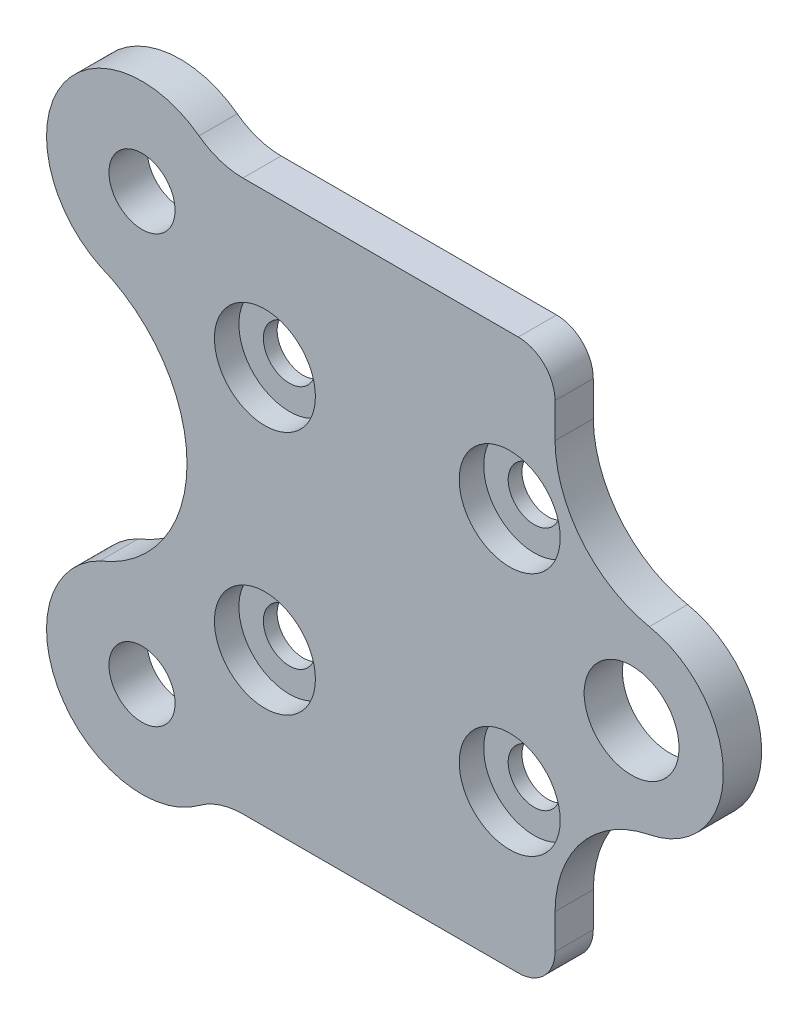
ISO-10303-21;
HEADER;
FILE_DESCRIPTION(('STEP AP214'),'2;1');
FILE_NAME('part.step','',(''),(''),'','','');
FILE_SCHEMA(('AUTOMOTIVE_DESIGN { 1 0 10303 214 1 1 1 1 }'));
ENDSEC;
DATA;
#1=APPLICATION_CONTEXT('core data for automotive mechanical design processes');
#2=APPLICATION_PROTOCOL_DEFINITION('international standard','automotive_design',2000,#1);
#3=PRODUCT_CONTEXT('',#1,'mechanical');
#4=PRODUCT('Part','Part','',(#3));
#5=PRODUCT_RELATED_PRODUCT_CATEGORY('part','',(#4));
#6=PRODUCT_DEFINITION_FORMATION('','',#4);
#7=PRODUCT_DEFINITION_CONTEXT('part definition',#1,'design');
#8=PRODUCT_DEFINITION('design','',#6,#7);
#9=PRODUCT_DEFINITION_SHAPE('','',#8);
#10=(LENGTH_UNIT() NAMED_UNIT(*) SI_UNIT(.MILLI.,.METRE.));
#11=(NAMED_UNIT(*) PLANE_ANGLE_UNIT() SI_UNIT($,.RADIAN.));
#12=(NAMED_UNIT(*) SI_UNIT($,.STERADIAN.) SOLID_ANGLE_UNIT());
#13=UNCERTAINTY_MEASURE_WITH_UNIT(LENGTH_MEASURE(1.E-05),#10,'distance_accuracy_value','');
#14=(GEOMETRIC_REPRESENTATION_CONTEXT(3) GLOBAL_UNCERTAINTY_ASSIGNED_CONTEXT((#13)) GLOBAL_UNIT_ASSIGNED_CONTEXT((#10,
#11,#12)) REPRESENTATION_CONTEXT('',''));
#15=CARTESIAN_POINT('',(0.,0.,0.));
#16=DIRECTION('',(0.,0.,1.));
#17=DIRECTION('',(1.,0.,0.));
#18=AXIS2_PLACEMENT_3D('',#15,#16,#17);
#19=CARTESIAN_POINT('',(82.0500548673,27.4305081809208,-3.125));
#20=DIRECTION('',(0.,0.,1.));
#21=DIRECTION('',(1.,0.,0.));
#22=AXIS2_PLACEMENT_3D('',#19,#20,#21);
#23=CYLINDRICAL_SURFACE('',#22,2.125);
#24=CARTESIAN_POINT('',(82.0500548673,27.4305081809208,-3.125));
#25=DIRECTION('',(0.,0.,1.));
#26=DIRECTION('',(1.,0.,0.));
#27=AXIS2_PLACEMENT_3D('',#24,#25,#26);
#28=CIRCLE('',#27,2.125);
#29=CARTESIAN_POINT('',(84.1750548673,27.4305081809208,-3.125));
#30=VERTEX_POINT('',#29);
#31=EDGE_CURVE('E619',#30,#30,#28,.T.);
#32=ORIENTED_EDGE('',*,*,#31,.F.);
#33=EDGE_LOOP('',(#32));
#34=FACE_BOUND('',#33,.T.);
#35=CARTESIAN_POINT('',(82.0500548673,27.4305081809208,-2.));
#36=DIRECTION('',(0.,0.,1.));
#37=DIRECTION('',(1.,0.,0.));
#38=AXIS2_PLACEMENT_3D('',#35,#36,#37);
#39=CIRCLE('',#38,2.125);
#40=CARTESIAN_POINT('',(84.1750548673,27.4305081809208,-2.));
#41=VERTEX_POINT('',#40);
#42=EDGE_CURVE('E440',#41,#41,#39,.F.);
#43=ORIENTED_EDGE('',*,*,#42,.F.);
#44=EDGE_LOOP('',(#43));
#45=FACE_BOUND('',#44,.T.);
#46=ADVANCED_FACE('F263',(#34,#45),#23,.F.);
#47=CARTESIAN_POINT('',(62.05010788,27.4305081809208,-3.125));
#48=DIRECTION('',(0.,0.,1.));
#49=DIRECTION('',(1.,0.,0.));
#50=AXIS2_PLACEMENT_3D('',#47,#48,#49);
#51=CYLINDRICAL_SURFACE('',#50,2.12500000000001);
#52=CARTESIAN_POINT('',(62.05010788,27.4305081809208,-3.125));
#53=DIRECTION('',(0.,0.,1.));
#54=DIRECTION('',(1.,0.,0.));
#55=AXIS2_PLACEMENT_3D('',#52,#53,#54);
#56=CIRCLE('',#55,2.12500000000001);
#57=CARTESIAN_POINT('',(64.17510788,27.4305081809208,-3.125));
#58=VERTEX_POINT('',#57);
#59=EDGE_CURVE('E622',#58,#58,#56,.T.);
#60=ORIENTED_EDGE('',*,*,#59,.F.);
#61=EDGE_LOOP('',(#60));
#62=FACE_BOUND('',#61,.T.);
#63=CARTESIAN_POINT('',(62.05010788,27.4305081809208,-2.));
#64=DIRECTION('',(0.,0.,1.));
#65=DIRECTION('',(1.,0.,0.));
#66=AXIS2_PLACEMENT_3D('',#63,#64,#65);
#67=CIRCLE('',#66,2.12500000000001);
#68=CARTESIAN_POINT('',(64.17510788,27.4305081809208,-2.));
#69=VERTEX_POINT('',#68);
#70=EDGE_CURVE('E661',#69,#69,#67,.T.);
#71=ORIENTED_EDGE('',*,*,#70,.T.);
#72=EDGE_LOOP('',(#71));
#73=FACE_BOUND('',#72,.T.);
#74=ADVANCED_FACE('F534',(#62,#73),#51,.F.);
#75=CARTESIAN_POINT('',(62.05010788,7.43050818092083,-3.125));
#76=DIRECTION('',(0.,0.,1.));
#77=DIRECTION('',(1.,0.,0.));
#78=AXIS2_PLACEMENT_3D('',#75,#76,#77);
#79=CYLINDRICAL_SURFACE('',#78,2.125);
#80=CARTESIAN_POINT('',(62.05010788,7.43050818092083,-3.125));
#81=DIRECTION('',(0.,0.,1.));
#82=DIRECTION('',(1.,0.,0.));
#83=AXIS2_PLACEMENT_3D('',#80,#81,#82);
#84=CIRCLE('',#83,2.125);
#85=CARTESIAN_POINT('',(64.17510788,7.43050818092083,-3.125));
#86=VERTEX_POINT('',#85);
#87=EDGE_CURVE('E607',#86,#86,#84,.T.);
#88=ORIENTED_EDGE('',*,*,#87,.F.);
#89=EDGE_LOOP('',(#88));
#90=FACE_BOUND('',#89,.T.);
#91=CARTESIAN_POINT('',(62.05010788,7.43050818092083,-2.));
#92=DIRECTION('',(0.,0.,1.));
#93=DIRECTION('',(1.,0.,0.));
#94=AXIS2_PLACEMENT_3D('',#91,#92,#93);
#95=CIRCLE('',#94,2.125);
#96=CARTESIAN_POINT('',(64.17510788,7.43050818092083,-2.));
#97=VERTEX_POINT('',#96);
#98=EDGE_CURVE('E613',#97,#97,#95,.T.);
#99=ORIENTED_EDGE('',*,*,#98,.T.);
#100=EDGE_LOOP('',(#99));
#101=FACE_BOUND('',#100,.T.);
#102=ADVANCED_FACE('F540',(#90,#101),#79,.F.);
#103=CARTESIAN_POINT('',(82.0500548673,7.43050818092083,-3.125));
#104=DIRECTION('',(0.,0.,1.));
#105=DIRECTION('',(1.,0.,0.));
#106=AXIS2_PLACEMENT_3D('',#103,#104,#105);
#107=CYLINDRICAL_SURFACE('',#106,2.125);
#108=CARTESIAN_POINT('',(82.0500548673,7.43050818092083,-3.125));
#109=DIRECTION('',(0.,0.,1.));
#110=DIRECTION('',(1.,0.,0.));
#111=AXIS2_PLACEMENT_3D('',#108,#109,#110);
#112=CIRCLE('',#111,2.125);
#113=CARTESIAN_POINT('',(84.1750548673,7.43050818092083,-3.125));
#114=VERTEX_POINT('',#113);
#115=EDGE_CURVE('E598',#114,#114,#112,.T.);
#116=ORIENTED_EDGE('',*,*,#115,.F.);
#117=EDGE_LOOP('',(#116));
#118=FACE_BOUND('',#117,.T.);
#119=CARTESIAN_POINT('',(82.0500548673,7.43050818092083,-2.));
#120=DIRECTION('',(0.,0.,1.));
#121=DIRECTION('',(1.,0.,0.));
#122=AXIS2_PLACEMENT_3D('',#119,#120,#121);
#123=CIRCLE('',#122,2.125);
#124=CARTESIAN_POINT('',(84.1750548673,7.43050818092083,-2.));
#125=VERTEX_POINT('',#124);
#126=EDGE_CURVE('E601',#125,#125,#123,.T.);
#127=ORIENTED_EDGE('',*,*,#126,.T.);
#128=EDGE_LOOP('',(#127));
#129=FACE_BOUND('',#128,.T.);
#130=ADVANCED_FACE('F546',(#118,#129),#107,.F.);
#131=CARTESIAN_POINT('',(52.0082075214231,-0.00478709079274138,-3.125));
#132=DIRECTION('',(0.,0.,1.));
#133=DIRECTION('',(1.,0.,0.));
#134=AXIS2_PLACEMENT_3D('',#131,#132,#133);
#135=CYLINDRICAL_SURFACE('',#134,7.80000000000975);
#136=CARTESIAN_POINT('',(52.0082075214231,-0.00478709079274138,-3.125));
#137=DIRECTION('',(0.,0.,1.));
#138=DIRECTION('',(1.,0.,0.));
#139=AXIS2_PLACEMENT_3D('',#136,#137,#138);
#140=CIRCLE('',#139,7.80000000000975);
#141=CARTESIAN_POINT('',(48.5735901579423,6.99831247772894,-3.125));
#142=VERTEX_POINT('',#141);
#143=CARTESIAN_POINT('',(56.6695313692701,-6.25875063287107,-3.125));
#144=VERTEX_POINT('',#143);
#145=EDGE_CURVE('E390',#142,#144,#140,.T.);
#146=ORIENTED_EDGE('',*,*,#145,.T.);
#147=DIRECTION('',(0.,0.,1.));
#148=VECTOR('',#147,1.);
#149=CARTESIAN_POINT('',(56.6695313692701,-6.25875063287107,-3.125));
#150=LINE('',#149,#148);
#151=CARTESIAN_POINT('',(56.6695313692701,-6.25875063287107,0.));
#152=VERTEX_POINT('',#151);
#153=EDGE_CURVE('E468',#144,#152,#150,.T.);
#154=ORIENTED_EDGE('',*,*,#153,.T.);
#155=CARTESIAN_POINT('',(52.0082075214231,-0.00478709079274138,0.));
#156=DIRECTION('',(0.,0.,1.));
#157=DIRECTION('',(1.,0.,0.));
#158=AXIS2_PLACEMENT_3D('',#155,#156,#157);
#159=CIRCLE('',#158,7.80000000000975);
#160=CARTESIAN_POINT('',(48.5735901579423,6.99831247772894,0.));
#161=VERTEX_POINT('',#160);
#162=EDGE_CURVE('E405',#161,#152,#159,.T.);
#163=ORIENTED_EDGE('',*,*,#162,.F.);
#164=DIRECTION('',(0.,0.,1.));
#165=VECTOR('',#164,1.);
#166=CARTESIAN_POINT('',(48.5735901579423,6.99831247772894,-3.125));
#167=LINE('',#166,#165);
#168=EDGE_CURVE('E428',#142,#161,#167,.T.);
#169=ORIENTED_EDGE('',*,*,#168,.F.);
#170=EDGE_LOOP('',(#146,#154,#163,#169));
#171=FACE_BOUND('',#170,.T.);
#172=ADVANCED_FACE('F500',(#171),#135,.T.);
#173=CARTESIAN_POINT('',(44.4800195239708,17.4305081809208,-3.125));
#174=DIRECTION('',(0.,0.,1.));
#175=DIRECTION('',(1.,0.,0.));
#176=AXIS2_PLACEMENT_3D('',#173,#174,#175);
#177=CYLINDRICAL_SURFACE('',#176,11.2066064321457);
#178=CARTESIAN_POINT('',(44.4800195239708,17.4305081809208,0.));
#179=DIRECTION('',(0.,0.,1.));
#180=DIRECTION('',(1.,0.,0.));
#181=AXIS2_PLACEMENT_3D('',#178,#179,#180);
#182=CIRCLE('',#181,11.2066064321457);
#183=CARTESIAN_POINT('',(48.5735901579423,27.8627038841127,0.));
#184=VERTEX_POINT('',#183);
#185=EDGE_CURVE('E426',#161,#184,#182,.T.);
#186=ORIENTED_EDGE('',*,*,#185,.T.);
#187=DIRECTION('',(0.,0.,1.));
#188=VECTOR('',#187,1.);
#189=CARTESIAN_POINT('',(48.5735901579423,27.8627038841127,-3.125));
#190=LINE('',#189,#188);
#191=CARTESIAN_POINT('',(48.5735901579423,27.8627038841127,-3.125));
#192=VERTEX_POINT('',#191);
#193=EDGE_CURVE('E431',#192,#184,#190,.T.);
#194=ORIENTED_EDGE('',*,*,#193,.F.);
#195=CARTESIAN_POINT('',(44.4800195239708,17.4305081809208,-3.125));
#196=DIRECTION('',(0.,0.,1.));
#197=DIRECTION('',(1.,0.,0.));
#198=AXIS2_PLACEMENT_3D('',#195,#196,#197);
#199=CIRCLE('',#198,11.2066064321457);
#200=EDGE_CURVE('E383',#142,#192,#199,.T.);
#201=ORIENTED_EDGE('',*,*,#200,.F.);
#202=ORIENTED_EDGE('',*,*,#168,.T.);
#203=EDGE_LOOP('',(#186,#194,#201,#202));
#204=FACE_BOUND('',#203,.T.);
#205=ADVANCED_FACE('F495',(#204),#177,.F.);
#206=CARTESIAN_POINT('',(52.0082075214231,34.8658034526344,-3.125));
#207=DIRECTION('',(0.,0.,1.));
#208=DIRECTION('',(1.,0.,0.));
#209=AXIS2_PLACEMENT_3D('',#206,#207,#208);
#210=CYLINDRICAL_SURFACE('',#209,7.80000000000975);
#211=CARTESIAN_POINT('',(52.0082075214231,34.8658034526344,0.));
#212=DIRECTION('',(0.,0.,-1.));
#213=DIRECTION('',(-1.,0.,0.));
#214=AXIS2_PLACEMENT_3D('',#211,#212,#213);
#215=CIRCLE('',#214,7.80000000000975);
#216=CARTESIAN_POINT('',(56.6695313692701,41.1197669947127,0.));
#217=VERTEX_POINT('',#216);
#218=EDGE_CURVE('E423',#184,#217,#215,.T.);
#219=ORIENTED_EDGE('',*,*,#218,.T.);
#220=DIRECTION('',(0.,0.,1.));
#221=VECTOR('',#220,1.);
#222=CARTESIAN_POINT('',(56.6695313692701,41.1197669947127,-3.125));
#223=LINE('',#222,#221);
#224=CARTESIAN_POINT('',(56.6695313692701,41.1197669947127,-3.125));
#225=VERTEX_POINT('',#224);
#226=EDGE_CURVE('E466',#217,#225,#223,.F.);
#227=ORIENTED_EDGE('',*,*,#226,.T.);
#228=CARTESIAN_POINT('',(52.0082075214231,34.8658034526344,-3.125));
#229=DIRECTION('',(0.,0.,-1.));
#230=DIRECTION('',(-1.,0.,0.));
#231=AXIS2_PLACEMENT_3D('',#228,#229,#230);
#232=CIRCLE('',#231,7.80000000000975);
#233=EDGE_CURVE('E401',#192,#225,#232,.T.);
#234=ORIENTED_EDGE('',*,*,#233,.F.);
#235=ORIENTED_EDGE('',*,*,#193,.T.);
#236=EDGE_LOOP('',(#219,#227,#234,#235));
#237=FACE_BOUND('',#236,.T.);
#238=ADVANCED_FACE('F491',(#237),#210,.T.);
#239=CARTESIAN_POINT('',(57.940219491693,39.9305081809208,-3.125));
#240=DIRECTION('',(0.,-1.,0.));
#241=DIRECTION('',(0.,0.,-1.));
#242=AXIS2_PLACEMENT_3D('',#239,#240,#241);
#243=PLANE('',#242);
#244=DIRECTION('',(1.,0.,0.));
#245=VECTOR('',#244,1.);
#246=CARTESIAN_POINT('',(57.940219491693,39.9305081809208,-3.125));
#247=LINE('',#246,#245);
#248=CARTESIAN_POINT('',(60.2551650983787,39.9305081809208,-3.125));
#249=VERTEX_POINT('',#248);
#250=CARTESIAN_POINT('',(82.7511654582989,39.9305081809208,-3.125));
#251=VERTEX_POINT('',#250);
#252=EDGE_CURVE('E399',#249,#251,#247,.T.);
#253=ORIENTED_EDGE('',*,*,#252,.F.);
#254=DIRECTION('',(0.,0.,-1.));
#255=VECTOR('',#254,1.);
#256=CARTESIAN_POINT('',(60.2551650983787,39.9305081809208,0.));
#257=LINE('',#256,#255);
#258=CARTESIAN_POINT('',(60.2551650983787,39.9305081809208,0.));
#259=VERTEX_POINT('',#258);
#260=EDGE_CURVE('E463',#249,#259,#257,.F.);
#261=ORIENTED_EDGE('',*,*,#260,.T.);
#262=DIRECTION('',(1.,0.,0.));
#263=VECTOR('',#262,1.);
#264=CARTESIAN_POINT('',(57.940219491693,39.9305081809208,0.));
#265=LINE('',#264,#263);
#266=CARTESIAN_POINT('',(82.7511654582989,39.9305081809208,0.));
#267=VERTEX_POINT('',#266);
#268=EDGE_CURVE('E421',#259,#267,#265,.T.);
#269=ORIENTED_EDGE('',*,*,#268,.T.);
#270=DIRECTION('',(0.,0.,1.));
#271=VECTOR('',#270,1.);
#272=CARTESIAN_POINT('',(82.7511654582989,39.9305081809208,-3.125));
#273=LINE('',#272,#271);
#274=EDGE_CURVE('E460',#267,#251,#273,.F.);
#275=ORIENTED_EDGE('',*,*,#274,.T.);
#276=EDGE_LOOP('',(#253,#261,#269,#275));
#277=FACE_BOUND('',#276,.T.);
#278=ADVANCED_FACE('F482',(#277),#243,.F.);
#279=CARTESIAN_POINT('',(85.7511654582989,39.9305081809208,-3.125));
#280=DIRECTION('',(-1.,0.,0.));
#281=DIRECTION('',(0.,-1.,0.));
#282=AXIS2_PLACEMENT_3D('',#279,#280,#281);
#283=PLANE('',#282);
#284=DIRECTION('',(0.,-1.,0.));
#285=VECTOR('',#284,1.);
#286=CARTESIAN_POINT('',(85.7511654582989,39.9305081809208,-3.125));
#287=LINE('',#286,#285);
#288=CARTESIAN_POINT('',(85.7511654582989,36.9305081809208,-3.125));
#289=VERTEX_POINT('',#288);
#290=CARTESIAN_POINT('',(85.7511654582988,34.0911124146329,-3.125));
#291=VERTEX_POINT('',#290);
#292=EDGE_CURVE('E397',#289,#291,#287,.T.);
#293=ORIENTED_EDGE('',*,*,#292,.F.);
#294=DIRECTION('',(0.,0.,1.));
#295=VECTOR('',#294,1.);
#296=CARTESIAN_POINT('',(85.7511654582989,36.9305081809208,-3.125));
#297=LINE('',#296,#295);
#298=CARTESIAN_POINT('',(85.7511654582989,36.9305081809208,0.));
#299=VERTEX_POINT('',#298);
#300=EDGE_CURVE('E457',#289,#299,#297,.T.);
#301=ORIENTED_EDGE('',*,*,#300,.T.);
#302=DIRECTION('',(0.,-1.,0.));
#303=VECTOR('',#302,1.);
#304=CARTESIAN_POINT('',(85.7511654582989,39.9305081809208,0.));
#305=LINE('',#304,#303);
#306=CARTESIAN_POINT('',(85.7511654582988,34.0911124146329,0.));
#307=VERTEX_POINT('',#306);
#308=EDGE_CURVE('E419',#299,#307,#305,.T.);
#309=ORIENTED_EDGE('',*,*,#308,.T.);
#310=DIRECTION('',(0.,0.,1.));
#311=VECTOR('',#310,1.);
#312=CARTESIAN_POINT('',(85.7511654582988,34.0911124146329,-3.125));
#313=LINE('',#312,#311);
#314=EDGE_CURVE('E434',#291,#307,#313,.T.);
#315=ORIENTED_EDGE('',*,*,#314,.F.);
#316=EDGE_LOOP('',(#293,#301,#309,#315));
#317=FACE_BOUND('',#316,.T.);
#318=ADVANCED_FACE('F521',(#317),#283,.F.);
#319=CARTESIAN_POINT('',(95.3555620860846,34.2048076301968,-3.125));
#320=DIRECTION('',(0.,0.,1.));
#321=DIRECTION('',(1.,0.,0.));
#322=AXIS2_PLACEMENT_3D('',#319,#320,#321);
#323=CYLINDRICAL_SURFACE('',#322,9.60506955653446);
#324=CARTESIAN_POINT('',(95.3555620860846,34.2048076301968,0.));
#325=DIRECTION('',(0.,0.,1.));
#326=DIRECTION('',(1.,0.,0.));
#327=AXIS2_PLACEMENT_3D('',#324,#325,#326);
#328=CIRCLE('',#327,9.60506955653446);
#329=CARTESIAN_POINT('',(93.4574363423077,24.7891568376772,0.));
#330=VERTEX_POINT('',#329);
#331=EDGE_CURVE('E416',#307,#330,#328,.T.);
#332=ORIENTED_EDGE('',*,*,#331,.T.);
#333=DIRECTION('',(0.,0.,1.));
#334=VECTOR('',#333,1.);
#335=CARTESIAN_POINT('',(93.4574363423077,24.7891568376772,-3.125));
#336=LINE('',#335,#334);
#337=CARTESIAN_POINT('',(93.4574363423077,24.7891568376772,-3.125));
#338=VERTEX_POINT('',#337);
#339=EDGE_CURVE('E437',#338,#330,#336,.T.);
#340=ORIENTED_EDGE('',*,*,#339,.F.);
#341=CARTESIAN_POINT('',(95.3555620860846,34.2048076301968,-3.125));
#342=DIRECTION('',(0.,0.,1.));
#343=DIRECTION('',(1.,0.,0.));
#344=AXIS2_PLACEMENT_3D('',#341,#342,#343);
#345=CIRCLE('',#344,9.60506955653446);
#346=EDGE_CURVE('E395',#291,#338,#345,.T.);
#347=ORIENTED_EDGE('',*,*,#346,.F.);
#348=ORIENTED_EDGE('',*,*,#314,.T.);
#349=EDGE_LOOP('',(#332,#340,#347,#348));
#350=FACE_BOUND('',#349,.T.);
#351=ADVANCED_FACE('F516',(#350),#323,.F.);
#352=CARTESIAN_POINT('',(92.0081986301231,17.4305081809208,-3.125));
#353=DIRECTION('',(0.,0.,1.));
#354=DIRECTION('',(1.,0.,0.));
#355=AXIS2_PLACEMENT_3D('',#352,#353,#354);
#356=CYLINDRICAL_SURFACE('',#355,7.49999999999999);
#357=CARTESIAN_POINT('',(92.0081986301231,17.4305081809208,0.));
#358=DIRECTION('',(0.,0.,1.));
#359=DIRECTION('',(1.,0.,0.));
#360=AXIS2_PLACEMENT_3D('',#357,#358,#359);
#361=CIRCLE('',#360,7.49999999999999);
#362=CARTESIAN_POINT('',(93.4574363423077,10.0718595241645,0.));
#363=VERTEX_POINT('',#362);
#364=EDGE_CURVE('E413',#363,#330,#361,.T.);
#365=ORIENTED_EDGE('',*,*,#364,.F.);
#366=DIRECTION('',(0.,0.,1.));
#367=VECTOR('',#366,1.);
#368=CARTESIAN_POINT('',(93.4574363423077,10.0718595241645,-3.125));
#369=LINE('',#368,#367);
#370=CARTESIAN_POINT('',(93.4574363423077,10.0718595241645,-3.125));
#371=VERTEX_POINT('',#370);
#372=EDGE_CURVE('E382',#371,#363,#369,.T.);
#373=ORIENTED_EDGE('',*,*,#372,.F.);
#374=CARTESIAN_POINT('',(92.0081986301231,17.4305081809208,-3.125));
#375=DIRECTION('',(0.,0.,1.));
#376=DIRECTION('',(1.,0.,0.));
#377=AXIS2_PLACEMENT_3D('',#374,#375,#376);
#378=CIRCLE('',#377,7.49999999999999);
#379=EDGE_CURVE('E371',#371,#338,#378,.T.);
#380=ORIENTED_EDGE('',*,*,#379,.T.);
#381=ORIENTED_EDGE('',*,*,#339,.T.);
#382=EDGE_LOOP('',(#365,#373,#380,#381));
#383=FACE_BOUND('',#382,.T.);
#384=ADVANCED_FACE('F512',(#383),#356,.T.);
#385=CARTESIAN_POINT('',(95.3555620860846,0.656208731644823,-3.125));
#386=DIRECTION('',(0.,0.,1.));
#387=DIRECTION('',(1.,0.,0.));
#388=AXIS2_PLACEMENT_3D('',#385,#386,#387);
#389=CYLINDRICAL_SURFACE('',#388,9.60506955653445);
#390=CARTESIAN_POINT('',(95.3555620860846,0.656208731644823,0.));
#391=DIRECTION('',(0.,0.,1.));
#392=DIRECTION('',(1.,0.,0.));
#393=AXIS2_PLACEMENT_3D('',#390,#391,#392);
#394=CIRCLE('',#393,9.60506955653445);
#395=CARTESIAN_POINT('',(85.7511654582988,0.769903947208809,0.));
#396=VERTEX_POINT('',#395);
#397=EDGE_CURVE('E378',#363,#396,#394,.T.);
#398=ORIENTED_EDGE('',*,*,#397,.T.);
#399=DIRECTION('',(0.,0.,1.));
#400=VECTOR('',#399,1.);
#401=CARTESIAN_POINT('',(85.7511654582988,0.769903947208809,-3.125));
#402=LINE('',#401,#400);
#403=CARTESIAN_POINT('',(85.7511654582988,0.769903947208809,-3.125));
#404=VERTEX_POINT('',#403);
#405=EDGE_CURVE('E375',#404,#396,#402,.T.);
#406=ORIENTED_EDGE('',*,*,#405,.F.);
#407=CARTESIAN_POINT('',(95.3555620860846,0.656208731644823,-3.125));
#408=DIRECTION('',(0.,0.,1.));
#409=DIRECTION('',(1.,0.,0.));
#410=AXIS2_PLACEMENT_3D('',#407,#408,#409);
#411=CIRCLE('',#410,9.60506955653445);
#412=EDGE_CURVE('E363',#371,#404,#411,.T.);
#413=ORIENTED_EDGE('',*,*,#412,.F.);
#414=ORIENTED_EDGE('',*,*,#372,.T.);
#415=EDGE_LOOP('',(#398,#406,#413,#414));
#416=FACE_BOUND('',#415,.T.);
#417=ADVANCED_FACE('F376',(#416),#389,.F.);
#418=CARTESIAN_POINT('',(85.7511654582988,0.769903947208809,-3.125));
#419=DIRECTION('',(-1.,0.,0.));
#420=DIRECTION('',(0.,-1.,0.));
#421=AXIS2_PLACEMENT_3D('',#418,#419,#420);
#422=PLANE('',#421);
#423=DIRECTION('',(0.,-1.,0.));
#424=VECTOR('',#423,1.);
#425=CARTESIAN_POINT('',(85.7511654582988,0.769903947208809,0.));
#426=LINE('',#425,#424);
#427=CARTESIAN_POINT('',(85.7511654582989,-2.06949181907912,0.));
#428=VERTEX_POINT('',#427);
#429=EDGE_CURVE('E410',#396,#428,#426,.T.);
#430=ORIENTED_EDGE('',*,*,#429,.T.);
#431=DIRECTION('',(0.,0.,1.));
#432=VECTOR('',#431,1.);
#433=CARTESIAN_POINT('',(85.7511654582989,-2.06949181907912,-3.125));
#434=LINE('',#433,#432);
#435=CARTESIAN_POINT('',(85.7511654582989,-2.06949181907912,-3.125));
#436=VERTEX_POINT('',#435);
#437=EDGE_CURVE('E387',#428,#436,#434,.F.);
#438=ORIENTED_EDGE('',*,*,#437,.T.);
#439=DIRECTION('',(0.,-1.,0.));
#440=VECTOR('',#439,1.);
#441=CARTESIAN_POINT('',(85.7511654582988,0.769903947208809,-3.125));
#442=LINE('',#441,#440);
#443=EDGE_CURVE('E368',#404,#436,#442,.T.);
#444=ORIENTED_EDGE('',*,*,#443,.F.);
#445=ORIENTED_EDGE('',*,*,#405,.T.);
#446=EDGE_LOOP('',(#430,#438,#444,#445));
#447=FACE_BOUND('',#446,.T.);
#448=ADVANCED_FACE('F385',(#447),#422,.F.);
#449=CARTESIAN_POINT('',(57.940219491693,-5.06949181907916,-3.125));
#450=DIRECTION('',(0.,-1.,0.));
#451=DIRECTION('',(1.,0.,0.));
#452=AXIS2_PLACEMENT_3D('',#449,#450,#451);
#453=PLANE('',#452);
#454=DIRECTION('',(1.,0.,0.));
#455=VECTOR('',#454,1.);
#456=CARTESIAN_POINT('',(57.940219491693,-5.06949181907916,0.));
#457=LINE('',#456,#455);
#458=CARTESIAN_POINT('',(60.2551650983787,-5.06949181907916,0.));
#459=VERTEX_POINT('',#458);
#460=CARTESIAN_POINT('',(82.7511654582989,-5.06949181907915,0.));
#461=VERTEX_POINT('',#460);
#462=EDGE_CURVE('E407',#459,#461,#457,.T.);
#463=ORIENTED_EDGE('',*,*,#462,.F.);
#464=DIRECTION('',(0.,0.,-1.));
#465=VECTOR('',#464,1.);
#466=CARTESIAN_POINT('',(60.2551650983787,-5.06949181907916,-3.125));
#467=LINE('',#466,#465);
#468=CARTESIAN_POINT('',(60.2551650983787,-5.06949181907916,-3.125));
#469=VERTEX_POINT('',#468);
#470=EDGE_CURVE('E284',#459,#469,#467,.T.);
#471=ORIENTED_EDGE('',*,*,#470,.T.);
#472=DIRECTION('',(1.,0.,0.));
#473=VECTOR('',#472,1.);
#474=CARTESIAN_POINT('',(57.940219491693,-5.06949181907916,-3.125));
#475=LINE('',#474,#473);
#476=CARTESIAN_POINT('',(82.7511654582989,-5.06949181907915,-3.125));
#477=VERTEX_POINT('',#476);
#478=EDGE_CURVE('E388',#469,#477,#475,.T.);
#479=ORIENTED_EDGE('',*,*,#478,.T.);
#480=DIRECTION('',(0.,0.,1.));
#481=VECTOR('',#480,1.);
#482=CARTESIAN_POINT('',(82.7511654582989,-5.06949181907915,0.));
#483=LINE('',#482,#481);
#484=EDGE_CURVE('E430',#477,#461,#483,.T.);
#485=ORIENTED_EDGE('',*,*,#484,.T.);
#486=EDGE_LOOP('',(#463,#471,#479,#485));
#487=FACE_BOUND('',#486,.T.);
#488=ADVANCED_FACE('F505',(#487),#453,.T.);
#489=CARTESIAN_POINT('',(52.0082075214231,-0.00478709079274138,-3.125));
#490=DIRECTION('',(0.,0.,1.));
#491=DIRECTION('',(1.,0.,0.));
#492=AXIS2_PLACEMENT_3D('',#489,#490,#491);
#493=PLANE('',#492);
#494=ORIENTED_EDGE('',*,*,#87,.T.);
#495=EDGE_LOOP('',(#494));
#496=FACE_BOUND('',#495,.T.);
#497=ORIENTED_EDGE('',*,*,#115,.T.);
#498=EDGE_LOOP('',(#497));
#499=FACE_BOUND('',#498,.T.);
#500=ORIENTED_EDGE('',*,*,#31,.T.);
#501=EDGE_LOOP('',(#500));
#502=FACE_BOUND('',#501,.T.);
#503=ORIENTED_EDGE('',*,*,#59,.T.);
#504=EDGE_LOOP('',(#503));
#505=FACE_BOUND('',#504,.T.);
#506=CARTESIAN_POINT('',(92.0081986301231,17.4305081809208,-3.125));
#507=DIRECTION('',(0.,0.,1.));
#508=DIRECTION('',(1.,0.,0.));
#509=AXIS2_PLACEMENT_3D('',#506,#507,#508);
#510=CIRCLE('',#509,3.875);
#511=CARTESIAN_POINT('',(95.8831986301231,17.4305081809208,-3.125));
#512=VERTEX_POINT('',#511);
#513=EDGE_CURVE('E626',#512,#512,#510,.T.);
#514=ORIENTED_EDGE('',*,*,#513,.T.);
#515=EDGE_LOOP('',(#514));
#516=FACE_BOUND('',#515,.T.);
#517=CARTESIAN_POINT('',(52.0082075214231,-0.00478709079274138,-3.125));
#518=DIRECTION('',(0.,0.,1.));
#519=DIRECTION('',(1.,0.,0.));
#520=AXIS2_PLACEMENT_3D('',#517,#518,#519);
#521=CIRCLE('',#520,2.7);
#522=CARTESIAN_POINT('',(54.7082075214231,-0.00478709079274138,-3.125));
#523=VERTEX_POINT('',#522);
#524=EDGE_CURVE('E632',#523,#523,#521,.T.);
#525=ORIENTED_EDGE('',*,*,#524,.T.);
#526=EDGE_LOOP('',(#525));
#527=FACE_BOUND('',#526,.T.);
#528=CARTESIAN_POINT('',(52.0082075214231,34.8658034526344,-3.125));
#529=DIRECTION('',(0.,0.,1.));
#530=DIRECTION('',(1.,0.,0.));
#531=AXIS2_PLACEMENT_3D('',#528,#529,#530);
#532=CIRCLE('',#531,2.70000000000001);
#533=CARTESIAN_POINT('',(54.7082075214231,34.8658034526344,-3.125));
#534=VERTEX_POINT('',#533);
#535=EDGE_CURVE('E408',#534,#534,#532,.T.);
#536=ORIENTED_EDGE('',*,*,#535,.T.);
#537=EDGE_LOOP('',(#536));
#538=FACE_BOUND('',#537,.T.);
#539=ORIENTED_EDGE('',*,*,#443,.T.);
#540=CARTESIAN_POINT('',(82.7511654582989,-2.06949181907915,-3.125));
#541=DIRECTION('',(0.,0.,1.));
#542=DIRECTION('',(1.,0.,0.));
#543=AXIS2_PLACEMENT_3D('',#540,#541,#542);
#544=CIRCLE('',#543,3.);
#545=EDGE_CURVE('E455',#436,#477,#544,.F.);
#546=ORIENTED_EDGE('',*,*,#545,.T.);
#547=ORIENTED_EDGE('',*,*,#478,.F.);
#548=CARTESIAN_POINT('',(60.2551650983787,-11.0694918190792,-3.125));
#549=DIRECTION('',(0.,0.,1.));
#550=DIRECTION('',(1.,0.,0.));
#551=AXIS2_PLACEMENT_3D('',#548,#549,#550);
#552=CIRCLE('',#551,6.);
#553=EDGE_CURVE('E12',#469,#144,#552,.T.);
#554=ORIENTED_EDGE('',*,*,#553,.T.);
#555=ORIENTED_EDGE('',*,*,#145,.F.);
#556=ORIENTED_EDGE('',*,*,#200,.T.);
#557=ORIENTED_EDGE('',*,*,#233,.T.);
#558=CARTESIAN_POINT('',(60.2551650983787,45.9305081809208,-3.125));
#559=DIRECTION('',(0.,0.,1.));
#560=DIRECTION('',(1.,0.,0.));
#561=AXIS2_PLACEMENT_3D('',#558,#559,#560);
#562=CIRCLE('',#561,6.);
#563=EDGE_CURVE('E474',#225,#249,#562,.T.);
#564=ORIENTED_EDGE('',*,*,#563,.T.);
#565=ORIENTED_EDGE('',*,*,#252,.T.);
#566=CARTESIAN_POINT('',(82.7511654582989,36.9305081809208,-3.125));
#567=DIRECTION('',(0.,0.,1.));
#568=DIRECTION('',(1.,0.,0.));
#569=AXIS2_PLACEMENT_3D('',#566,#567,#568);
#570=CIRCLE('',#569,3.);
#571=EDGE_CURVE('E453',#251,#289,#570,.F.);
#572=ORIENTED_EDGE('',*,*,#571,.T.);
#573=ORIENTED_EDGE('',*,*,#292,.T.);
#574=ORIENTED_EDGE('',*,*,#346,.T.);
#575=ORIENTED_EDGE('',*,*,#379,.F.);
#576=ORIENTED_EDGE('',*,*,#412,.T.);
#577=EDGE_LOOP('',(#539,#546,#547,#554,#555,#556,#557,#564,#565,#572,#573,#574,#575,#576));
#578=FACE_BOUND('',#577,.T.);
#579=ADVANCED_FACE('F365',(#496,#499,#502,#505,#516,#527,#538,#578),#493,.F.);
#580=CARTESIAN_POINT('',(52.0082075214231,-0.00478709079274138,0.));
#581=DIRECTION('',(0.,0.,1.));
#582=DIRECTION('',(1.,0.,0.));
#583=AXIS2_PLACEMENT_3D('',#580,#581,#582);
#584=PLANE('',#583);
#585=CARTESIAN_POINT('',(82.0500548673,27.4305081809208,0.));
#586=DIRECTION('',(0.,0.,1.));
#587=DIRECTION('',(1.,0.,0.));
#588=AXIS2_PLACEMENT_3D('',#585,#586,#587);
#589=CIRCLE('',#588,4.125);
#590=CARTESIAN_POINT('',(86.1750548673,27.4305081809208,0.));
#591=VERTEX_POINT('',#590);
#592=EDGE_CURVE('E444',#591,#591,#589,.T.);
#593=ORIENTED_EDGE('',*,*,#592,.F.);
#594=EDGE_LOOP('',(#593));
#595=FACE_BOUND('',#594,.T.);
#596=CARTESIAN_POINT('',(62.05010788,27.4305081809208,0.));
#597=DIRECTION('',(0.,0.,1.));
#598=DIRECTION('',(1.,0.,0.));
#599=AXIS2_PLACEMENT_3D('',#596,#597,#598);
#600=CIRCLE('',#599,4.12500000000001);
#601=CARTESIAN_POINT('',(66.17510788,27.4305081809208,0.));
#602=VERTEX_POINT('',#601);
#603=EDGE_CURVE('E663',#602,#602,#600,.T.);
#604=ORIENTED_EDGE('',*,*,#603,.F.);
#605=EDGE_LOOP('',(#604));
#606=FACE_BOUND('',#605,.T.);
#607=CARTESIAN_POINT('',(62.05010788,7.43050818092083,0.));
#608=DIRECTION('',(0.,0.,1.));
#609=DIRECTION('',(1.,0.,0.));
#610=AXIS2_PLACEMENT_3D('',#607,#608,#609);
#611=CIRCLE('',#610,4.12499999999999);
#612=CARTESIAN_POINT('',(66.17510788,7.43050818092083,0.));
#613=VERTEX_POINT('',#612);
#614=EDGE_CURVE('E610',#613,#613,#611,.T.);
#615=ORIENTED_EDGE('',*,*,#614,.F.);
#616=EDGE_LOOP('',(#615));
#617=FACE_BOUND('',#616,.T.);
#618=CARTESIAN_POINT('',(82.0500548673,7.43050818092083,0.));
#619=DIRECTION('',(0.,0.,1.));
#620=DIRECTION('',(1.,0.,0.));
#621=AXIS2_PLACEMENT_3D('',#618,#619,#620);
#622=CIRCLE('',#621,4.125);
#623=CARTESIAN_POINT('',(86.1750548673,7.43050818092083,0.));
#624=VERTEX_POINT('',#623);
#625=EDGE_CURVE('E604',#624,#624,#622,.T.);
#626=ORIENTED_EDGE('',*,*,#625,.F.);
#627=EDGE_LOOP('',(#626));
#628=FACE_BOUND('',#627,.T.);
#629=CARTESIAN_POINT('',(92.0081986301231,17.4305081809208,0.));
#630=DIRECTION('',(0.,0.,1.));
#631=DIRECTION('',(1.,0.,0.));
#632=AXIS2_PLACEMENT_3D('',#629,#630,#631);
#633=CIRCLE('',#632,3.875);
#634=CARTESIAN_POINT('',(95.8831986301231,17.4305081809208,0.));
#635=VERTEX_POINT('',#634);
#636=EDGE_CURVE('E625',#635,#635,#633,.T.);
#637=ORIENTED_EDGE('',*,*,#636,.F.);
#638=EDGE_LOOP('',(#637));
#639=FACE_BOUND('',#638,.T.);
#640=CARTESIAN_POINT('',(52.0082075214231,-0.00478709079274138,0.));
#641=DIRECTION('',(0.,0.,1.));
#642=DIRECTION('',(1.,0.,0.));
#643=AXIS2_PLACEMENT_3D('',#640,#641,#642);
#644=CIRCLE('',#643,2.7);
#645=CARTESIAN_POINT('',(54.7082075214231,-0.00478709079274138,0.));
#646=VERTEX_POINT('',#645);
#647=EDGE_CURVE('E629',#646,#646,#644,.T.);
#648=ORIENTED_EDGE('',*,*,#647,.F.);
#649=EDGE_LOOP('',(#648));
#650=FACE_BOUND('',#649,.T.);
#651=CARTESIAN_POINT('',(52.0082075214231,34.8658034526344,0.));
#652=DIRECTION('',(0.,0.,1.));
#653=DIRECTION('',(1.,0.,0.));
#654=AXIS2_PLACEMENT_3D('',#651,#652,#653);
#655=CIRCLE('',#654,2.70000000000001);
#656=CARTESIAN_POINT('',(54.7082075214231,34.8658034526344,0.));
#657=VERTEX_POINT('',#656);
#658=EDGE_CURVE('E635',#657,#657,#655,.T.);
#659=ORIENTED_EDGE('',*,*,#658,.F.);
#660=EDGE_LOOP('',(#659));
#661=FACE_BOUND('',#660,.T.);
#662=ORIENTED_EDGE('',*,*,#162,.T.);
#663=CARTESIAN_POINT('',(60.2551650983787,-11.0694918190792,0.));
#664=DIRECTION('',(0.,0.,1.));
#665=DIRECTION('',(1.,0.,0.));
#666=AXIS2_PLACEMENT_3D('',#663,#664,#665);
#667=CIRCLE('',#666,6.);
#668=EDGE_CURVE('E271',#152,#459,#667,.F.);
#669=ORIENTED_EDGE('',*,*,#668,.T.);
#670=ORIENTED_EDGE('',*,*,#462,.T.);
#671=CARTESIAN_POINT('',(82.7511654582989,-2.06949181907915,0.));
#672=DIRECTION('',(0.,0.,1.));
#673=DIRECTION('',(1.,0.,0.));
#674=AXIS2_PLACEMENT_3D('',#671,#672,#673);
#675=CIRCLE('',#674,3.);
#676=EDGE_CURVE('E450',#461,#428,#675,.T.);
#677=ORIENTED_EDGE('',*,*,#676,.T.);
#678=ORIENTED_EDGE('',*,*,#429,.F.);
#679=ORIENTED_EDGE('',*,*,#397,.F.);
#680=ORIENTED_EDGE('',*,*,#364,.T.);
#681=ORIENTED_EDGE('',*,*,#331,.F.);
#682=ORIENTED_EDGE('',*,*,#308,.F.);
#683=CARTESIAN_POINT('',(82.7511654582989,36.9305081809208,0.));
#684=DIRECTION('',(0.,0.,1.));
#685=DIRECTION('',(1.,0.,0.));
#686=AXIS2_PLACEMENT_3D('',#683,#684,#685);
#687=CIRCLE('',#686,3.);
#688=EDGE_CURVE('E447',#299,#267,#687,.T.);
#689=ORIENTED_EDGE('',*,*,#688,.T.);
#690=ORIENTED_EDGE('',*,*,#268,.F.);
#691=CARTESIAN_POINT('',(60.2551650983787,45.9305081809208,0.));
#692=DIRECTION('',(0.,0.,1.));
#693=DIRECTION('',(1.,0.,0.));
#694=AXIS2_PLACEMENT_3D('',#691,#692,#693);
#695=CIRCLE('',#694,6.);
#696=EDGE_CURVE('E472',#259,#217,#695,.F.);
#697=ORIENTED_EDGE('',*,*,#696,.T.);
#698=ORIENTED_EDGE('',*,*,#218,.F.);
#699=ORIENTED_EDGE('',*,*,#185,.F.);
#700=EDGE_LOOP('',(#662,#669,#670,#677,#678,#679,#680,#681,#682,#689,#690,#697,#698,#699));
#701=FACE_BOUND('',#700,.T.);
#702=ADVANCED_FACE('F488',(#595,#606,#617,#628,#639,#650,#661,#701),#584,.T.);
#703=CARTESIAN_POINT('',(52.0082075214231,34.8658034526344,-3.125));
#704=DIRECTION('',(0.,0.,1.));
#705=DIRECTION('',(1.,0.,0.));
#706=AXIS2_PLACEMENT_3D('',#703,#704,#705);
#707=CYLINDRICAL_SURFACE('',#706,2.70000000000001);
#708=ORIENTED_EDGE('',*,*,#535,.F.);
#709=EDGE_LOOP('',(#708));
#710=FACE_BOUND('',#709,.T.);
#711=ORIENTED_EDGE('',*,*,#658,.T.);
#712=EDGE_LOOP('',(#711));
#713=FACE_BOUND('',#712,.T.);
#714=ADVANCED_FACE('F557',(#710,#713),#707,.F.);
#715=CARTESIAN_POINT('',(52.0082075214231,-0.00478709079274138,-3.125));
#716=DIRECTION('',(0.,0.,1.));
#717=DIRECTION('',(1.,0.,0.));
#718=AXIS2_PLACEMENT_3D('',#715,#716,#717);
#719=CYLINDRICAL_SURFACE('',#718,2.7);
#720=ORIENTED_EDGE('',*,*,#524,.F.);
#721=EDGE_LOOP('',(#720));
#722=FACE_BOUND('',#721,.T.);
#723=ORIENTED_EDGE('',*,*,#647,.T.);
#724=EDGE_LOOP('',(#723));
#725=FACE_BOUND('',#724,.T.);
#726=ADVANCED_FACE('F553',(#722,#725),#719,.F.);
#727=CARTESIAN_POINT('',(92.0081986301231,17.4305081809208,-3.125));
#728=DIRECTION('',(0.,0.,1.));
#729=DIRECTION('',(1.,0.,0.));
#730=AXIS2_PLACEMENT_3D('',#727,#728,#729);
#731=CYLINDRICAL_SURFACE('',#730,3.875);
#732=ORIENTED_EDGE('',*,*,#513,.F.);
#733=EDGE_LOOP('',(#732));
#734=FACE_BOUND('',#733,.T.);
#735=ORIENTED_EDGE('',*,*,#636,.T.);
#736=EDGE_LOOP('',(#735));
#737=FACE_BOUND('',#736,.T.);
#738=ADVANCED_FACE('F549',(#734,#737),#731,.F.);
#739=CARTESIAN_POINT('',(82.0500548673,7.43050818092083,-2.));
#740=DIRECTION('',(0.,0.,1.));
#741=DIRECTION('',(1.,0.,0.));
#742=AXIS2_PLACEMENT_3D('',#739,#740,#741);
#743=CYLINDRICAL_SURFACE('',#742,4.125);
#744=CARTESIAN_POINT('',(82.0500548673,7.43050818092083,-2.));
#745=DIRECTION('',(0.,0.,1.));
#746=DIRECTION('',(1.,0.,0.));
#747=AXIS2_PLACEMENT_3D('',#744,#745,#746);
#748=CIRCLE('',#747,4.125);
#749=CARTESIAN_POINT('',(86.1750548673,7.43050818092083,-2.));
#750=VERTEX_POINT('',#749);
#751=EDGE_CURVE('E603',#750,#750,#748,.T.);
#752=ORIENTED_EDGE('',*,*,#751,.F.);
#753=EDGE_LOOP('',(#752));
#754=FACE_BOUND('',#753,.T.);
#755=ORIENTED_EDGE('',*,*,#625,.T.);
#756=EDGE_LOOP('',(#755));
#757=FACE_BOUND('',#756,.T.);
#758=ADVANCED_FACE('F552',(#754,#757),#743,.F.);
#759=CARTESIAN_POINT('',(0.,0.,-2.));
#760=DIRECTION('',(0.,0.,1.));
#761=DIRECTION('',(1.,0.,0.));
#762=AXIS2_PLACEMENT_3D('',#759,#760,#761);
#763=PLANE('',#762);
#764=ORIENTED_EDGE('',*,*,#126,.F.);
#765=EDGE_LOOP('',(#764));
#766=FACE_BOUND('',#765,.T.);
#767=ORIENTED_EDGE('',*,*,#751,.T.);
#768=EDGE_LOOP('',(#767));
#769=FACE_BOUND('',#768,.T.);
#770=ADVANCED_FACE('F691',(#766,#769),#763,.T.);
#771=CARTESIAN_POINT('',(62.05010788,7.43050818092083,-2.));
#772=DIRECTION('',(0.,0.,1.));
#773=DIRECTION('',(1.,0.,0.));
#774=AXIS2_PLACEMENT_3D('',#771,#772,#773);
#775=CYLINDRICAL_SURFACE('',#774,4.12499999999999);
#776=CARTESIAN_POINT('',(62.05010788,7.43050818092083,-2.));
#777=DIRECTION('',(0.,0.,1.));
#778=DIRECTION('',(1.,0.,0.));
#779=AXIS2_PLACEMENT_3D('',#776,#777,#778);
#780=CIRCLE('',#779,4.12499999999999);
#781=CARTESIAN_POINT('',(66.17510788,7.43050818092083,-2.));
#782=VERTEX_POINT('',#781);
#783=EDGE_CURVE('E666',#782,#782,#780,.T.);
#784=ORIENTED_EDGE('',*,*,#783,.F.);
#785=EDGE_LOOP('',(#784));
#786=FACE_BOUND('',#785,.T.);
#787=ORIENTED_EDGE('',*,*,#614,.T.);
#788=EDGE_LOOP('',(#787));
#789=FACE_BOUND('',#788,.T.);
#790=ADVANCED_FACE('F682',(#786,#789),#775,.F.);
#791=CARTESIAN_POINT('',(0.,0.,-2.));
#792=DIRECTION('',(0.,0.,1.));
#793=DIRECTION('',(1.,0.,0.));
#794=AXIS2_PLACEMENT_3D('',#791,#792,#793);
#795=PLANE('',#794);
#796=ORIENTED_EDGE('',*,*,#98,.F.);
#797=EDGE_LOOP('',(#796));
#798=FACE_BOUND('',#797,.T.);
#799=ORIENTED_EDGE('',*,*,#783,.T.);
#800=EDGE_LOOP('',(#799));
#801=FACE_BOUND('',#800,.T.);
#802=ADVANCED_FACE('F679',(#798,#801),#795,.T.);
#803=CARTESIAN_POINT('',(62.05010788,27.4305081809208,-2.));
#804=DIRECTION('',(0.,0.,1.));
#805=DIRECTION('',(1.,0.,0.));
#806=AXIS2_PLACEMENT_3D('',#803,#804,#805);
#807=CYLINDRICAL_SURFACE('',#806,4.12500000000001);
#808=CARTESIAN_POINT('',(62.05010788,27.4305081809208,-2.));
#809=DIRECTION('',(0.,0.,1.));
#810=DIRECTION('',(1.,0.,0.));
#811=AXIS2_PLACEMENT_3D('',#808,#809,#810);
#812=CIRCLE('',#811,4.12500000000001);
#813=CARTESIAN_POINT('',(66.17510788,27.4305081809208,-2.));
#814=VERTEX_POINT('',#813);
#815=EDGE_CURVE('E443',#814,#814,#812,.T.);
#816=ORIENTED_EDGE('',*,*,#815,.F.);
#817=EDGE_LOOP('',(#816));
#818=FACE_BOUND('',#817,.T.);
#819=ORIENTED_EDGE('',*,*,#603,.T.);
#820=EDGE_LOOP('',(#819));
#821=FACE_BOUND('',#820,.T.);
#822=ADVANCED_FACE('F681',(#818,#821),#807,.F.);
#823=CARTESIAN_POINT('',(0.,0.,-2.));
#824=DIRECTION('',(0.,0.,1.));
#825=DIRECTION('',(1.,0.,0.));
#826=AXIS2_PLACEMENT_3D('',#823,#824,#825);
#827=PLANE('',#826);
#828=ORIENTED_EDGE('',*,*,#70,.F.);
#829=EDGE_LOOP('',(#828));
#830=FACE_BOUND('',#829,.T.);
#831=ORIENTED_EDGE('',*,*,#815,.T.);
#832=EDGE_LOOP('',(#831));
#833=FACE_BOUND('',#832,.T.);
#834=ADVANCED_FACE('F688',(#830,#833),#827,.T.);
#835=CARTESIAN_POINT('',(82.0500548673,27.4305081809208,-2.));
#836=DIRECTION('',(0.,0.,1.));
#837=DIRECTION('',(1.,0.,0.));
#838=AXIS2_PLACEMENT_3D('',#835,#836,#837);
#839=PLANE('',#838);
#840=CARTESIAN_POINT('',(82.0500548673,27.4305081809208,-2.));
#841=DIRECTION('',(0.,0.,1.));
#842=DIRECTION('',(1.,0.,0.));
#843=AXIS2_PLACEMENT_3D('',#840,#841,#842);
#844=CIRCLE('',#843,4.125);
#845=CARTESIAN_POINT('',(86.1750548673,27.4305081809208,-2.));
#846=VERTEX_POINT('',#845);
#847=EDGE_CURVE('E929',#846,#846,#844,.T.);
#848=ORIENTED_EDGE('',*,*,#847,.T.);
#849=EDGE_LOOP('',(#848));
#850=FACE_BOUND('',#849,.T.);
#851=ORIENTED_EDGE('',*,*,#42,.T.);
#852=EDGE_LOOP('',(#851));
#853=FACE_BOUND('',#852,.T.);
#854=ADVANCED_FACE('F736',(#850,#853),#839,.T.);
#855=CARTESIAN_POINT('',(82.0500548673,27.4305081809208,-2.));
#856=DIRECTION('',(0.,0.,1.));
#857=DIRECTION('',(1.,0.,0.));
#858=AXIS2_PLACEMENT_3D('',#855,#856,#857);
#859=CYLINDRICAL_SURFACE('',#858,4.125);
#860=ORIENTED_EDGE('',*,*,#847,.F.);
#861=EDGE_LOOP('',(#860));
#862=FACE_BOUND('',#861,.T.);
#863=ORIENTED_EDGE('',*,*,#592,.T.);
#864=EDGE_LOOP('',(#863));
#865=FACE_BOUND('',#864,.T.);
#866=ADVANCED_FACE('F531',(#862,#865),#859,.F.);
#867=CARTESIAN_POINT('',(82.7511654582989,-2.06949181907915,-3.125));
#868=DIRECTION('',(0.,0.,-1.));
#869=DIRECTION('',(-1.,0.,0.));
#870=AXIS2_PLACEMENT_3D('',#867,#868,#869);
#871=CYLINDRICAL_SURFACE('',#870,3.);
#872=ORIENTED_EDGE('',*,*,#545,.F.);
#873=ORIENTED_EDGE('',*,*,#437,.F.);
#874=ORIENTED_EDGE('',*,*,#676,.F.);
#875=ORIENTED_EDGE('',*,*,#484,.F.);
#876=EDGE_LOOP('',(#872,#873,#874,#875));
#877=FACE_BOUND('',#876,.T.);
#878=ADVANCED_FACE('F508',(#877),#871,.T.);
#879=CARTESIAN_POINT('',(82.7511654582989,36.9305081809208,-3.125));
#880=DIRECTION('',(0.,0.,1.));
#881=DIRECTION('',(1.,0.,0.));
#882=AXIS2_PLACEMENT_3D('',#879,#880,#881);
#883=CYLINDRICAL_SURFACE('',#882,3.);
#884=ORIENTED_EDGE('',*,*,#571,.F.);
#885=ORIENTED_EDGE('',*,*,#274,.F.);
#886=ORIENTED_EDGE('',*,*,#688,.F.);
#887=ORIENTED_EDGE('',*,*,#300,.F.);
#888=EDGE_LOOP('',(#884,#885,#886,#887));
#889=FACE_BOUND('',#888,.T.);
#890=ADVANCED_FACE('F524',(#889),#883,.T.);
#891=CARTESIAN_POINT('',(60.2551650983787,45.9305081809208,-3.125));
#892=DIRECTION('',(0.,0.,1.));
#893=DIRECTION('',(1.,0.,0.));
#894=AXIS2_PLACEMENT_3D('',#891,#892,#893);
#895=CYLINDRICAL_SURFACE('',#894,6.);
#896=ORIENTED_EDGE('',*,*,#563,.F.);
#897=ORIENTED_EDGE('',*,*,#226,.F.);
#898=ORIENTED_EDGE('',*,*,#696,.F.);
#899=ORIENTED_EDGE('',*,*,#260,.F.);
#900=EDGE_LOOP('',(#896,#897,#898,#899));
#901=FACE_BOUND('',#900,.T.);
#902=ADVANCED_FACE('F486',(#901),#895,.F.);
#903=CARTESIAN_POINT('',(60.2551650983787,-11.0694918190792,-3.125));
#904=DIRECTION('',(0.,0.,1.));
#905=DIRECTION('',(1.,0.,0.));
#906=AXIS2_PLACEMENT_3D('',#903,#904,#905);
#907=CYLINDRICAL_SURFACE('',#906,6.);
#908=ORIENTED_EDGE('',*,*,#553,.F.);
#909=ORIENTED_EDGE('',*,*,#470,.F.);
#910=ORIENTED_EDGE('',*,*,#668,.F.);
#911=ORIENTED_EDGE('',*,*,#153,.F.);
#912=EDGE_LOOP('',(#908,#909,#910,#911));
#913=FACE_BOUND('',#912,.T.);
#914=ADVANCED_FACE('F265',(#913),#907,.F.);
#915=CLOSED_SHELL('',(#46,#74,#102,#130,#172,#205,#238,#278,#318,#351,#384,#417,#448,#488,#579,
#702,#714,#726,#738,#758,#770,#790,#802,#822,#834,#854,#866,#878,#890,#902,#914));
#916=MANIFOLD_SOLID_BREP('B2',#915);
#917=ADVANCED_BREP_SHAPE_REPRESENTATION('',(#18,#916),#14);
#918=SHAPE_DEFINITION_REPRESENTATION(#9,#917);
ENDSEC;
END-ISO-10303-21;
